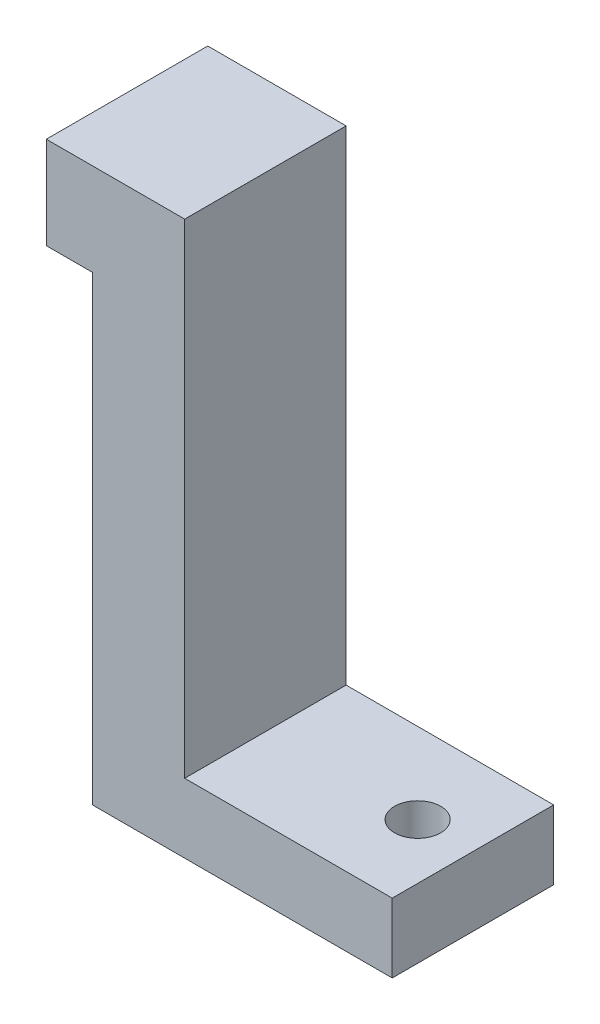
ISO-10303-21;
HEADER;
FILE_DESCRIPTION(('STEP AP214'),'2;1');
FILE_NAME('part.step','',(''),(''),'','','');
FILE_SCHEMA(('AUTOMOTIVE_DESIGN { 1 0 10303 214 1 1 1 1 }'));
ENDSEC;
DATA;
#1=APPLICATION_CONTEXT('core data for automotive mechanical design processes');
#2=APPLICATION_PROTOCOL_DEFINITION('international standard','automotive_design',2000,#1);
#3=PRODUCT_CONTEXT('',#1,'mechanical');
#4=PRODUCT('Part','Part','',(#3));
#5=PRODUCT_RELATED_PRODUCT_CATEGORY('part','',(#4));
#6=PRODUCT_DEFINITION_FORMATION('','',#4);
#7=PRODUCT_DEFINITION_CONTEXT('part definition',#1,'design');
#8=PRODUCT_DEFINITION('design','',#6,#7);
#9=PRODUCT_DEFINITION_SHAPE('','',#8);
#10=(LENGTH_UNIT() NAMED_UNIT(*) SI_UNIT(.MILLI.,.METRE.));
#11=(NAMED_UNIT(*) PLANE_ANGLE_UNIT() SI_UNIT($,.RADIAN.));
#12=(NAMED_UNIT(*) SI_UNIT($,.STERADIAN.) SOLID_ANGLE_UNIT());
#13=UNCERTAINTY_MEASURE_WITH_UNIT(LENGTH_MEASURE(1.E-05),#10,'distance_accuracy_value','');
#14=(GEOMETRIC_REPRESENTATION_CONTEXT(3) GLOBAL_UNCERTAINTY_ASSIGNED_CONTEXT((#13)) GLOBAL_UNIT_ASSIGNED_CONTEXT((#10,
#11,#12)) REPRESENTATION_CONTEXT('',''));
#15=CARTESIAN_POINT('',(0.,0.,0.));
#16=DIRECTION('',(0.,0.,1.));
#17=DIRECTION('',(1.,0.,0.));
#18=AXIS2_PLACEMENT_3D('',#15,#16,#17);
#19=CARTESIAN_POINT('',(0.5,0.,-1.));
#20=DIRECTION('',(-1.,0.,0.));
#21=DIRECTION('',(0.,-1.,0.));
#22=AXIS2_PLACEMENT_3D('',#19,#20,#21);
#23=PLANE('',#22);
#24=DIRECTION('',(0.,0.,1.));
#25=VECTOR('',#24,1.);
#26=CARTESIAN_POINT('',(0.499999999999999,3.,-1.));
#27=LINE('',#26,#25);
#28=CARTESIAN_POINT('',(0.499999999999999,3.,-1.));
#29=VERTEX_POINT('',#28);
#30=CARTESIAN_POINT('',(0.499999999999999,3.,0.75));
#31=VERTEX_POINT('',#30);
#32=EDGE_CURVE('E44',#29,#31,#27,.T.);
#33=ORIENTED_EDGE('',*,*,#32,.T.);
#34=DIRECTION('',(0.,-1.,0.));
#35=VECTOR('',#34,1.);
#36=CARTESIAN_POINT('',(0.5,0.,0.75));
#37=LINE('',#36,#35);
#38=CARTESIAN_POINT('',(0.5,-2.25,0.75));
#39=VERTEX_POINT('',#38);
#40=EDGE_CURVE('E108',#31,#39,#37,.T.);
#41=ORIENTED_EDGE('',*,*,#40,.T.);
#42=DIRECTION('',(0.,0.,1.));
#43=VECTOR('',#42,1.);
#44=CARTESIAN_POINT('',(0.5,-2.25,-1.));
#45=LINE('',#44,#43);
#46=CARTESIAN_POINT('',(0.5,-2.25,-1.));
#47=VERTEX_POINT('',#46);
#48=EDGE_CURVE('E11',#47,#39,#45,.T.);
#49=ORIENTED_EDGE('',*,*,#48,.F.);
#50=DIRECTION('',(0.,-1.,0.));
#51=VECTOR('',#50,1.);
#52=CARTESIAN_POINT('',(0.5,0.,-1.));
#53=LINE('',#52,#51);
#54=EDGE_CURVE('E110',#29,#47,#53,.T.);
#55=ORIENTED_EDGE('',*,*,#54,.F.);
#56=EDGE_LOOP('',(#33,#41,#49,#55));
#57=FACE_BOUND('',#56,.T.);
#58=ADVANCED_FACE('F41',(#57),#23,.F.);
#59=CARTESIAN_POINT('',(0.,-2.25,-1.));
#60=DIRECTION('',(0.,-1.,0.));
#61=DIRECTION('',(1.,0.,0.));
#62=AXIS2_PLACEMENT_3D('',#59,#60,#61);
#63=PLANE('',#62);
#64=CARTESIAN_POINT('',(2.15,-2.25,-0.125));
#65=DIRECTION('',(0.,1.,0.));
#66=DIRECTION('',(0.,0.,1.));
#67=AXIS2_PLACEMENT_3D('',#64,#65,#66);
#68=CIRCLE('',#67,0.25);
#69=CARTESIAN_POINT('',(2.15,-2.25,0.125));
#70=VERTEX_POINT('',#69);
#71=EDGE_CURVE('E251',#70,#70,#68,.T.);
#72=ORIENTED_EDGE('',*,*,#71,.F.);
#73=EDGE_LOOP('',(#72));
#74=FACE_BOUND('',#73,.T.);
#75=ORIENTED_EDGE('',*,*,#48,.T.);
#76=DIRECTION('',(1.,0.,0.));
#77=VECTOR('',#76,1.);
#78=CARTESIAN_POINT('',(0.,-2.25,0.75));
#79=LINE('',#78,#77);
#80=CARTESIAN_POINT('',(2.75,-2.25,0.75));
#81=VERTEX_POINT('',#80);
#82=EDGE_CURVE('E123',#39,#81,#79,.T.);
#83=ORIENTED_EDGE('',*,*,#82,.T.);
#84=DIRECTION('',(0.,0.,1.));
#85=VECTOR('',#84,1.);
#86=CARTESIAN_POINT('',(2.75,-2.25,-1.));
#87=LINE('',#86,#85);
#88=CARTESIAN_POINT('',(2.75,-2.25,-1.));
#89=VERTEX_POINT('',#88);
#90=EDGE_CURVE('E50',#89,#81,#87,.T.);
#91=ORIENTED_EDGE('',*,*,#90,.F.);
#92=DIRECTION('',(1.,0.,0.));
#93=VECTOR('',#92,1.);
#94=CARTESIAN_POINT('',(0.,-2.25,-1.));
#95=LINE('',#94,#93);
#96=EDGE_CURVE('E57',#47,#89,#95,.T.);
#97=ORIENTED_EDGE('',*,*,#96,.F.);
#98=EDGE_LOOP('',(#75,#83,#91,#97));
#99=FACE_BOUND('',#98,.T.);
#100=ADVANCED_FACE('F213',(#74,#99),#63,.F.);
#101=CARTESIAN_POINT('',(2.75,0.,-1.));
#102=DIRECTION('',(1.,0.,0.));
#103=DIRECTION('',(0.,0.,-1.));
#104=AXIS2_PLACEMENT_3D('',#101,#102,#103);
#105=PLANE('',#104);
#106=ORIENTED_EDGE('',*,*,#90,.T.);
#107=DIRECTION('',(0.,1.,0.));
#108=VECTOR('',#107,1.);
#109=CARTESIAN_POINT('',(2.75,0.,0.75));
#110=LINE('',#109,#108);
#111=CARTESIAN_POINT('',(2.75,-3.,0.75));
#112=VERTEX_POINT('',#111);
#113=EDGE_CURVE('E148',#112,#81,#110,.T.);
#114=ORIENTED_EDGE('',*,*,#113,.F.);
#115=DIRECTION('',(0.,0.,1.));
#116=VECTOR('',#115,1.);
#117=CARTESIAN_POINT('',(2.75,-3.,-1.));
#118=LINE('',#117,#116);
#119=CARTESIAN_POINT('',(2.75,-3.,-1.));
#120=VERTEX_POINT('',#119);
#121=EDGE_CURVE('E181',#120,#112,#118,.T.);
#122=ORIENTED_EDGE('',*,*,#121,.F.);
#123=DIRECTION('',(0.,1.,0.));
#124=VECTOR('',#123,1.);
#125=CARTESIAN_POINT('',(2.75,0.,-1.));
#126=LINE('',#125,#124);
#127=EDGE_CURVE('E173',#120,#89,#126,.T.);
#128=ORIENTED_EDGE('',*,*,#127,.T.);
#129=EDGE_LOOP('',(#106,#114,#122,#128));
#130=FACE_BOUND('',#129,.T.);
#131=ADVANCED_FACE('F211',(#130),#105,.T.);
#132=CARTESIAN_POINT('',(0.,-3.,-1.));
#133=DIRECTION('',(0.,-1.,0.));
#134=DIRECTION('',(0.,0.,-1.));
#135=AXIS2_PLACEMENT_3D('',#132,#133,#134);
#136=PLANE('',#135);
#137=CARTESIAN_POINT('',(2.15,-3.,-0.125));
#138=DIRECTION('',(0.,-1.,0.));
#139=DIRECTION('',(0.,0.,-1.));
#140=AXIS2_PLACEMENT_3D('',#137,#138,#139);
#141=CIRCLE('',#140,0.25);
#142=CARTESIAN_POINT('',(2.15,-3.,-0.375));
#143=VERTEX_POINT('',#142);
#144=EDGE_CURVE('E125',#143,#143,#141,.T.);
#145=ORIENTED_EDGE('',*,*,#144,.F.);
#146=EDGE_LOOP('',(#145));
#147=FACE_BOUND('',#146,.T.);
#148=ORIENTED_EDGE('',*,*,#121,.T.);
#149=DIRECTION('',(1.,0.,0.));
#150=VECTOR('',#149,1.);
#151=CARTESIAN_POINT('',(0.,-3.,0.75));
#152=LINE('',#151,#150);
#153=CARTESIAN_POINT('',(-0.5,-3.,0.75));
#154=VERTEX_POINT('',#153);
#155=EDGE_CURVE('E144',#154,#112,#152,.T.);
#156=ORIENTED_EDGE('',*,*,#155,.F.);
#157=DIRECTION('',(0.,0.,1.));
#158=VECTOR('',#157,1.);
#159=CARTESIAN_POINT('',(-0.5,-3.,-1.));
#160=LINE('',#159,#158);
#161=CARTESIAN_POINT('',(-0.5,-3.,-1.));
#162=VERTEX_POINT('',#161);
#163=EDGE_CURVE('E184',#162,#154,#160,.T.);
#164=ORIENTED_EDGE('',*,*,#163,.F.);
#165=DIRECTION('',(1.,0.,0.));
#166=VECTOR('',#165,1.);
#167=CARTESIAN_POINT('',(0.,-3.,-1.));
#168=LINE('',#167,#166);
#169=EDGE_CURVE('E169',#162,#120,#168,.T.);
#170=ORIENTED_EDGE('',*,*,#169,.T.);
#171=EDGE_LOOP('',(#148,#156,#164,#170));
#172=FACE_BOUND('',#171,.T.);
#173=ADVANCED_FACE('F208',(#147,#172),#136,.T.);
#174=CARTESIAN_POINT('',(-0.5,0.,-1.));
#175=DIRECTION('',(-1.,0.,0.));
#176=DIRECTION('',(0.,-1.,0.));
#177=AXIS2_PLACEMENT_3D('',#174,#175,#176);
#178=PLANE('',#177);
#179=ORIENTED_EDGE('',*,*,#163,.T.);
#180=DIRECTION('',(0.,-1.,0.));
#181=VECTOR('',#180,1.);
#182=CARTESIAN_POINT('',(-0.5,0.,0.75));
#183=LINE('',#182,#181);
#184=CARTESIAN_POINT('',(-0.5,2.,0.75));
#185=VERTEX_POINT('',#184);
#186=EDGE_CURVE('E140',#185,#154,#183,.T.);
#187=ORIENTED_EDGE('',*,*,#186,.F.);
#188=DIRECTION('',(0.,0.,1.));
#189=VECTOR('',#188,1.);
#190=CARTESIAN_POINT('',(-0.5,2.,-1.));
#191=LINE('',#190,#189);
#192=CARTESIAN_POINT('',(-0.5,2.,-1.));
#193=VERTEX_POINT('',#192);
#194=EDGE_CURVE('E187',#193,#185,#191,.T.);
#195=ORIENTED_EDGE('',*,*,#194,.F.);
#196=DIRECTION('',(0.,-1.,0.));
#197=VECTOR('',#196,1.);
#198=CARTESIAN_POINT('',(-0.5,0.,-1.));
#199=LINE('',#198,#197);
#200=EDGE_CURVE('E165',#193,#162,#199,.T.);
#201=ORIENTED_EDGE('',*,*,#200,.T.);
#202=EDGE_LOOP('',(#179,#187,#195,#201));
#203=FACE_BOUND('',#202,.T.);
#204=ADVANCED_FACE('F204',(#203),#178,.T.);
#205=CARTESIAN_POINT('',(0.,2.,-1.));
#206=DIRECTION('',(0.,1.,0.));
#207=DIRECTION('',(0.,0.,1.));
#208=AXIS2_PLACEMENT_3D('',#205,#206,#207);
#209=PLANE('',#208);
#210=ORIENTED_EDGE('',*,*,#194,.T.);
#211=DIRECTION('',(-1.,0.,0.));
#212=VECTOR('',#211,1.);
#213=CARTESIAN_POINT('',(0.,2.,0.75));
#214=LINE('',#213,#212);
#215=CARTESIAN_POINT('',(-1.,2.,0.75));
#216=VERTEX_POINT('',#215);
#217=EDGE_CURVE('E133',#185,#216,#214,.T.);
#218=ORIENTED_EDGE('',*,*,#217,.T.);
#219=DIRECTION('',(0.,0.,1.));
#220=VECTOR('',#219,1.);
#221=CARTESIAN_POINT('',(-1.,2.,-1.));
#222=LINE('',#221,#220);
#223=CARTESIAN_POINT('',(-1.,2.,-1.));
#224=VERTEX_POINT('',#223);
#225=EDGE_CURVE('E190',#224,#216,#222,.T.);
#226=ORIENTED_EDGE('',*,*,#225,.F.);
#227=DIRECTION('',(-1.,0.,0.));
#228=VECTOR('',#227,1.);
#229=CARTESIAN_POINT('',(0.,2.,-1.));
#230=LINE('',#229,#228);
#231=EDGE_CURVE('E162',#193,#224,#230,.T.);
#232=ORIENTED_EDGE('',*,*,#231,.F.);
#233=EDGE_LOOP('',(#210,#218,#226,#232));
#234=FACE_BOUND('',#233,.T.);
#235=ADVANCED_FACE('F200',(#234),#209,.F.);
#236=CARTESIAN_POINT('',(-1.,0.,-1.));
#237=DIRECTION('',(-1.,0.,0.));
#238=DIRECTION('',(0.,-1.,0.));
#239=AXIS2_PLACEMENT_3D('',#236,#237,#238);
#240=PLANE('',#239);
#241=ORIENTED_EDGE('',*,*,#225,.T.);
#242=DIRECTION('',(0.,-1.,0.));
#243=VECTOR('',#242,1.);
#244=CARTESIAN_POINT('',(-1.,0.,0.75));
#245=LINE('',#244,#243);
#246=CARTESIAN_POINT('',(-1.,3.,0.75));
#247=VERTEX_POINT('',#246);
#248=EDGE_CURVE('E130',#247,#216,#245,.T.);
#249=ORIENTED_EDGE('',*,*,#248,.F.);
#250=DIRECTION('',(0.,0.,1.));
#251=VECTOR('',#250,1.);
#252=CARTESIAN_POINT('',(-1.,3.,-1.));
#253=LINE('',#252,#251);
#254=CARTESIAN_POINT('',(-1.,3.,-1.));
#255=VERTEX_POINT('',#254);
#256=EDGE_CURVE('E115',#255,#247,#253,.T.);
#257=ORIENTED_EDGE('',*,*,#256,.F.);
#258=DIRECTION('',(0.,-1.,0.));
#259=VECTOR('',#258,1.);
#260=CARTESIAN_POINT('',(-1.,0.,-1.));
#261=LINE('',#260,#259);
#262=EDGE_CURVE('E158',#255,#224,#261,.T.);
#263=ORIENTED_EDGE('',*,*,#262,.T.);
#264=EDGE_LOOP('',(#241,#249,#257,#263));
#265=FACE_BOUND('',#264,.T.);
#266=ADVANCED_FACE('F195',(#265),#240,.T.);
#267=CARTESIAN_POINT('',(0.,3.,-1.));
#268=DIRECTION('',(0.,-1.,0.));
#269=DIRECTION('',(0.,0.,-1.));
#270=AXIS2_PLACEMENT_3D('',#267,#268,#269);
#271=PLANE('',#270);
#272=ORIENTED_EDGE('',*,*,#256,.T.);
#273=DIRECTION('',(1.,0.,0.));
#274=VECTOR('',#273,1.);
#275=CARTESIAN_POINT('',(0.,3.,0.75));
#276=LINE('',#275,#274);
#277=EDGE_CURVE('E120',#247,#31,#276,.T.);
#278=ORIENTED_EDGE('',*,*,#277,.T.);
#279=ORIENTED_EDGE('',*,*,#32,.F.);
#280=DIRECTION('',(1.,0.,0.));
#281=VECTOR('',#280,1.);
#282=CARTESIAN_POINT('',(0.,3.,-1.));
#283=LINE('',#282,#281);
#284=EDGE_CURVE('E155',#255,#29,#283,.T.);
#285=ORIENTED_EDGE('',*,*,#284,.F.);
#286=EDGE_LOOP('',(#272,#278,#279,#285));
#287=FACE_BOUND('',#286,.T.);
#288=ADVANCED_FACE('F127',(#287),#271,.F.);
#289=CARTESIAN_POINT('',(0.,0.,-1.));
#290=DIRECTION('',(0.,0.,1.));
#291=DIRECTION('',(1.,0.,0.));
#292=AXIS2_PLACEMENT_3D('',#289,#290,#291);
#293=PLANE('',#292);
#294=ORIENTED_EDGE('',*,*,#54,.T.);
#295=ORIENTED_EDGE('',*,*,#96,.T.);
#296=ORIENTED_EDGE('',*,*,#127,.F.);
#297=ORIENTED_EDGE('',*,*,#169,.F.);
#298=ORIENTED_EDGE('',*,*,#200,.F.);
#299=ORIENTED_EDGE('',*,*,#231,.T.);
#300=ORIENTED_EDGE('',*,*,#262,.F.);
#301=ORIENTED_EDGE('',*,*,#284,.T.);
#302=EDGE_LOOP('',(#294,#295,#296,#297,#298,#299,#300,#301));
#303=FACE_BOUND('',#302,.T.);
#304=ADVANCED_FACE('F212',(#303),#293,.F.);
#305=CARTESIAN_POINT('',(0.,0.,0.75));
#306=DIRECTION('',(0.,0.,1.));
#307=DIRECTION('',(1.,0.,0.));
#308=AXIS2_PLACEMENT_3D('',#305,#306,#307);
#309=PLANE('',#308);
#310=ORIENTED_EDGE('',*,*,#40,.F.);
#311=ORIENTED_EDGE('',*,*,#277,.F.);
#312=ORIENTED_EDGE('',*,*,#248,.T.);
#313=ORIENTED_EDGE('',*,*,#217,.F.);
#314=ORIENTED_EDGE('',*,*,#186,.T.);
#315=ORIENTED_EDGE('',*,*,#155,.T.);
#316=ORIENTED_EDGE('',*,*,#113,.T.);
#317=ORIENTED_EDGE('',*,*,#82,.F.);
#318=EDGE_LOOP('',(#310,#311,#312,#313,#314,#315,#316,#317));
#319=FACE_BOUND('',#318,.T.);
#320=ADVANCED_FACE('F118',(#319),#309,.T.);
#321=CARTESIAN_POINT('',(2.15,-2.25,-0.125));
#322=DIRECTION('',(0.,1.,0.));
#323=DIRECTION('',(0.,0.,1.));
#324=AXIS2_PLACEMENT_3D('',#321,#322,#323);
#325=CYLINDRICAL_SURFACE('',#324,0.25);
#326=ORIENTED_EDGE('',*,*,#71,.T.);
#327=EDGE_LOOP('',(#326));
#328=FACE_BOUND('',#327,.T.);
#329=ORIENTED_EDGE('',*,*,#144,.T.);
#330=EDGE_LOOP('',(#329));
#331=FACE_BOUND('',#330,.T.);
#332=ADVANCED_FACE('F241',(#328,#331),#325,.F.);
#333=CLOSED_SHELL('',(#58,#100,#131,#173,#204,#235,#266,#288,#304,#320,#332));
#334=MANIFOLD_SOLID_BREP('B2',#333);
#335=ADVANCED_BREP_SHAPE_REPRESENTATION('',(#18,#334),#14);
#336=SHAPE_DEFINITION_REPRESENTATION(#9,#335);
ENDSEC;
END-ISO-10303-21;
